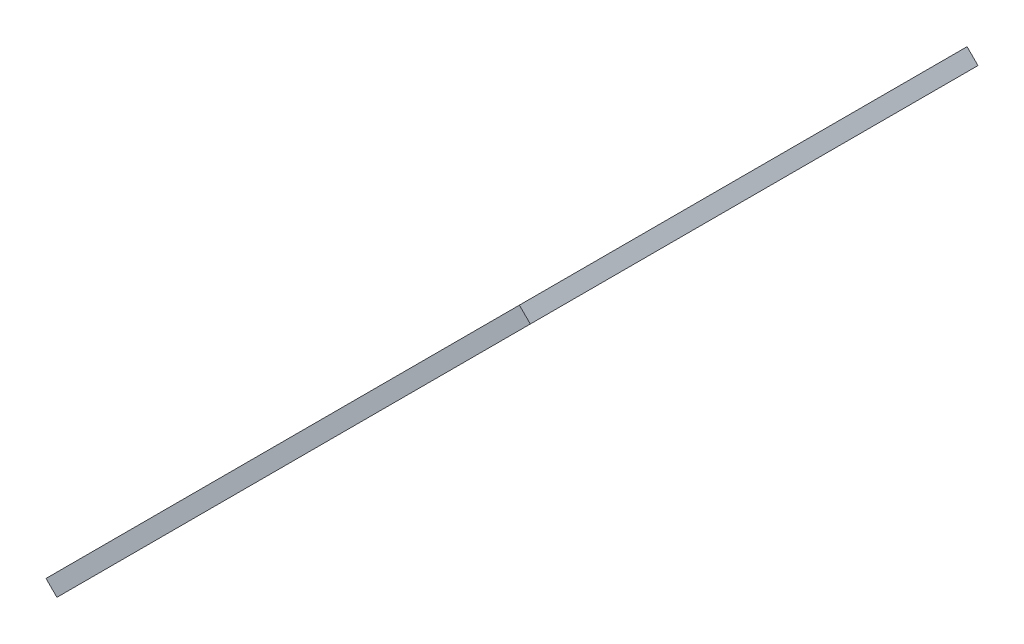
ISO-10303-21;
HEADER;
FILE_DESCRIPTION(('STEP AP214'),'2;1');
FILE_NAME('part.step','',(''),(''),'','','');
FILE_SCHEMA(('AUTOMOTIVE_DESIGN { 1 0 10303 214 1 1 1 1 }'));
ENDSEC;
DATA;
#1=APPLICATION_CONTEXT('core data for automotive mechanical design processes');
#2=APPLICATION_PROTOCOL_DEFINITION('international standard','automotive_design',2000,#1);
#3=PRODUCT_CONTEXT('',#1,'mechanical');
#4=PRODUCT('Part','Part','',(#3));
#5=PRODUCT_RELATED_PRODUCT_CATEGORY('part','',(#4));
#6=PRODUCT_DEFINITION_FORMATION('','',#4);
#7=PRODUCT_DEFINITION_CONTEXT('part definition',#1,'design');
#8=PRODUCT_DEFINITION('design','',#6,#7);
#9=PRODUCT_DEFINITION_SHAPE('','',#8);
#10=(LENGTH_UNIT() NAMED_UNIT(*) SI_UNIT(.MILLI.,.METRE.));
#11=(NAMED_UNIT(*) PLANE_ANGLE_UNIT() SI_UNIT($,.RADIAN.));
#12=(NAMED_UNIT(*) SI_UNIT($,.STERADIAN.) SOLID_ANGLE_UNIT());
#13=UNCERTAINTY_MEASURE_WITH_UNIT(LENGTH_MEASURE(1.E-05),#10,'distance_accuracy_value','');
#14=(GEOMETRIC_REPRESENTATION_CONTEXT(3) GLOBAL_UNCERTAINTY_ASSIGNED_CONTEXT((#13)) GLOBAL_UNIT_ASSIGNED_CONTEXT((#10,
#11,#12)) REPRESENTATION_CONTEXT('',''));
#15=CARTESIAN_POINT('',(0.,0.,0.));
#16=DIRECTION('',(0.,0.,1.));
#17=DIRECTION('',(1.,0.,0.));
#18=AXIS2_PLACEMENT_3D('',#15,#16,#17);
#19=CARTESIAN_POINT('',(-211.000000000001,83.3431457505084,0.));
#20=DIRECTION('',(-0.707106781186547,-0.707106781186548,0.));
#21=DIRECTION('',(0.,0.,-1.));
#22=AXIS2_PLACEMENT_3D('',#19,#20,#21);
#23=PLANE('',#22);
#24=DIRECTION('',(0.707106781186548,-0.707106781186547,0.));
#25=VECTOR('',#24,1.);
#26=CARTESIAN_POINT('',(-211.000000000001,83.3431457505084,116.));
#27=LINE('',#26,#25);
#28=CARTESIAN_POINT('',(-213.828427124747,86.1715728752546,116.));
#29=VERTEX_POINT('',#28);
#30=CARTESIAN_POINT('',(-211.000000000001,83.3431457505084,116.));
#31=VERTEX_POINT('',#30);
#32=EDGE_CURVE('E11',#29,#31,#27,.T.);
#33=ORIENTED_EDGE('',*,*,#32,.F.);
#34=DIRECTION('',(0.,0.,-1.));
#35=VECTOR('',#34,1.);
#36=CARTESIAN_POINT('',(-213.828427124747,86.1715728752546,0.));
#37=LINE('',#36,#35);
#38=CARTESIAN_POINT('',(-213.828427124747,86.1715728752547,0.));
#39=VERTEX_POINT('',#38);
#40=EDGE_CURVE('E134',#29,#39,#37,.T.);
#41=ORIENTED_EDGE('',*,*,#40,.T.);
#42=DIRECTION('',(0.707106781186548,-0.707106781186547,0.));
#43=VECTOR('',#42,1.);
#44=CARTESIAN_POINT('',(-211.000000000001,83.3431457505084,0.));
#45=LINE('',#44,#43);
#46=CARTESIAN_POINT('',(-211.000000000001,83.3431457505084,0.));
#47=VERTEX_POINT('',#46);
#48=EDGE_CURVE('E53',#39,#47,#45,.T.);
#49=ORIENTED_EDGE('',*,*,#48,.T.);
#50=DIRECTION('',(0.,0.,-1.));
#51=VECTOR('',#50,1.);
#52=CARTESIAN_POINT('',(-211.000000000001,83.3431457505084,0.));
#53=LINE('',#52,#51);
#54=EDGE_CURVE('E242',#31,#47,#53,.T.);
#55=ORIENTED_EDGE('',*,*,#54,.F.);
#56=EDGE_LOOP('',(#33,#41,#49,#55));
#57=FACE_BOUND('',#56,.T.);
#58=ADVANCED_FACE('F43',(#57),#23,.T.);
#59=CARTESIAN_POINT('',(-201.984192431566,92.3589533189436,0.));
#60=DIRECTION('',(0.,0.,-1.));
#61=DIRECTION('',(0.707106781186547,0.707106781186549,0.));
#62=AXIS2_PLACEMENT_3D('',#59,#60,#61);
#63=PLANE('',#62);
#64=ORIENTED_EDGE('',*,*,#48,.F.);
#65=DIRECTION('',(-0.707106781186547,-0.707106781186548,0.));
#66=VECTOR('',#65,1.);
#67=CARTESIAN_POINT('',(-150.000000000001,150.000000000001,0.));
#68=LINE('',#67,#66);
#69=CARTESIAN_POINT('',(-204.812619556312,95.1873804436898,0.));
#70=VERTEX_POINT('',#69);
#71=EDGE_CURVE('E196',#39,#70,#68,.F.);
#72=ORIENTED_EDGE('',*,*,#71,.T.);
#73=DIRECTION('',(0.707106781186548,-0.707106781186547,0.));
#74=VECTOR('',#73,1.);
#75=CARTESIAN_POINT('',(-201.984192431566,92.3589533189436,0.));
#76=LINE('',#75,#74);
#77=CARTESIAN_POINT('',(-201.984192431566,92.3589533189436,0.));
#78=VERTEX_POINT('',#77);
#79=EDGE_CURVE('E235',#70,#78,#76,.T.);
#80=ORIENTED_EDGE('',*,*,#79,.T.);
#81=DIRECTION('',(0.707106781186547,0.707106781186549,0.));
#82=VECTOR('',#81,1.);
#83=CARTESIAN_POINT('',(-201.984192431566,92.3589533189436,0.));
#84=LINE('',#83,#82);
#85=EDGE_CURVE('E251',#47,#78,#84,.T.);
#86=ORIENTED_EDGE('',*,*,#85,.F.);
#87=EDGE_LOOP('',(#64,#72,#80,#86));
#88=FACE_BOUND('',#87,.T.);
#89=ADVANCED_FACE('F255',(#88),#63,.T.);
#90=CARTESIAN_POINT('',(-201.984192431566,92.3589533189436,-3.00000000000003));
#91=DIRECTION('',(-0.707106781186547,-0.707106781186548,0.));
#92=DIRECTION('',(0.,0.,-1.));
#93=AXIS2_PLACEMENT_3D('',#90,#91,#92);
#94=PLANE('',#93);
#95=ORIENTED_EDGE('',*,*,#79,.F.);
#96=DIRECTION('',(0.,0.,-1.));
#97=VECTOR('',#96,1.);
#98=CARTESIAN_POINT('',(-204.812619556312,95.1873804436898,0.));
#99=LINE('',#98,#97);
#100=CARTESIAN_POINT('',(-204.812619556312,95.1873804436898,-3.00000000000003));
#101=VERTEX_POINT('',#100);
#102=EDGE_CURVE('E192',#70,#101,#99,.T.);
#103=ORIENTED_EDGE('',*,*,#102,.T.);
#104=DIRECTION('',(0.707106781186548,-0.707106781186547,0.));
#105=VECTOR('',#104,1.);
#106=CARTESIAN_POINT('',(-201.984192431566,92.3589533189436,-3.00000000000003));
#107=LINE('',#106,#105);
#108=CARTESIAN_POINT('',(-201.984192431566,92.3589533189436,-3.00000000000003));
#109=VERTEX_POINT('',#108);
#110=EDGE_CURVE('E232',#101,#109,#107,.T.);
#111=ORIENTED_EDGE('',*,*,#110,.T.);
#112=DIRECTION('',(0.,0.,-1.));
#113=VECTOR('',#112,1.);
#114=CARTESIAN_POINT('',(-201.984192431566,92.3589533189436,-3.00000000000003));
#115=LINE('',#114,#113);
#116=EDGE_CURVE('E257',#78,#109,#115,.T.);
#117=ORIENTED_EDGE('',*,*,#116,.F.);
#118=EDGE_LOOP('',(#95,#103,#111,#117));
#119=FACE_BOUND('',#118,.T.);
#120=ADVANCED_FACE('F332',(#119),#94,.T.);
#121=CARTESIAN_POINT('',(-195.620231400887,98.7229143496225,-3.00000000000003));
#122=DIRECTION('',(0.,0.,-1.));
#123=DIRECTION('',(0.707106781186547,0.707106781186547,0.));
#124=AXIS2_PLACEMENT_3D('',#121,#122,#123);
#125=PLANE('',#124);
#126=ORIENTED_EDGE('',*,*,#110,.F.);
#127=DIRECTION('',(-0.707106781186547,-0.707106781186548,0.));
#128=VECTOR('',#127,1.);
#129=CARTESIAN_POINT('',(-150.000000000001,150.000000000001,-3.00000000000003));
#130=LINE('',#129,#128);
#131=CARTESIAN_POINT('',(-198.448658525633,101.551341474369,-3.00000000000003));
#132=VERTEX_POINT('',#131);
#133=EDGE_CURVE('E188',#101,#132,#130,.F.);
#134=ORIENTED_EDGE('',*,*,#133,.T.);
#135=DIRECTION('',(0.707106781186548,-0.707106781186547,0.));
#136=VECTOR('',#135,1.);
#137=CARTESIAN_POINT('',(-195.620231400887,98.7229143496225,-3.00000000000003));
#138=LINE('',#137,#136);
#139=CARTESIAN_POINT('',(-195.620231400887,98.7229143496225,-3.00000000000003));
#140=VERTEX_POINT('',#139);
#141=EDGE_CURVE('E229',#132,#140,#138,.T.);
#142=ORIENTED_EDGE('',*,*,#141,.T.);
#143=DIRECTION('',(0.707106781186547,0.707106781186547,0.));
#144=VECTOR('',#143,1.);
#145=CARTESIAN_POINT('',(-195.620231400887,98.7229143496225,-3.00000000000003));
#146=LINE('',#145,#144);
#147=EDGE_CURVE('E261',#109,#140,#146,.T.);
#148=ORIENTED_EDGE('',*,*,#147,.F.);
#149=EDGE_LOOP('',(#126,#134,#142,#148));
#150=FACE_BOUND('',#149,.T.);
#151=ADVANCED_FACE('F337',(#150),#125,.T.);
#152=CARTESIAN_POINT('',(-195.620231400887,98.7229143496225,0.));
#153=DIRECTION('',(0.707106781186547,0.707106781186548,0.));
#154=DIRECTION('',(0.,0.,1.));
#155=AXIS2_PLACEMENT_3D('',#152,#153,#154);
#156=PLANE('',#155);
#157=ORIENTED_EDGE('',*,*,#141,.F.);
#158=DIRECTION('',(0.,0.,-1.));
#159=VECTOR('',#158,1.);
#160=CARTESIAN_POINT('',(-198.448658525633,101.551341474369,0.));
#161=LINE('',#160,#159);
#162=CARTESIAN_POINT('',(-198.448658525633,101.551341474369,0.));
#163=VERTEX_POINT('',#162);
#164=EDGE_CURVE('E184',#132,#163,#161,.F.);
#165=ORIENTED_EDGE('',*,*,#164,.T.);
#166=DIRECTION('',(0.707106781186548,-0.707106781186547,0.));
#167=VECTOR('',#166,1.);
#168=CARTESIAN_POINT('',(-195.620231400887,98.7229143496225,0.));
#169=LINE('',#168,#167);
#170=CARTESIAN_POINT('',(-195.620231400887,98.7229143496225,0.));
#171=VERTEX_POINT('',#170);
#172=EDGE_CURVE('E226',#163,#171,#169,.T.);
#173=ORIENTED_EDGE('',*,*,#172,.T.);
#174=DIRECTION('',(0.,0.,1.));
#175=VECTOR('',#174,1.);
#176=CARTESIAN_POINT('',(-195.620231400887,98.7229143496225,0.));
#177=LINE('',#176,#175);
#178=EDGE_CURVE('E268',#140,#171,#177,.T.);
#179=ORIENTED_EDGE('',*,*,#178,.F.);
#180=EDGE_LOOP('',(#157,#165,#173,#179));
#181=FACE_BOUND('',#180,.T.);
#182=ADVANCED_FACE('F341',(#181),#156,.T.);
#183=CARTESIAN_POINT('',(-161.3398657465,133.00328000401,0.));
#184=DIRECTION('',(0.,0.,-1.));
#185=DIRECTION('',(0.707106781186546,0.707106781186549,0.));
#186=AXIS2_PLACEMENT_3D('',#183,#184,#185);
#187=PLANE('',#186);
#188=ORIENTED_EDGE('',*,*,#172,.F.);
#189=DIRECTION('',(-0.707106781186547,-0.707106781186548,0.));
#190=VECTOR('',#189,1.);
#191=CARTESIAN_POINT('',(-150.000000000001,150.000000000001,0.));
#192=LINE('',#191,#190);
#193=CARTESIAN_POINT('',(-164.168292871246,135.831707128756,0.));
#194=VERTEX_POINT('',#193);
#195=EDGE_CURVE('E180',#163,#194,#192,.F.);
#196=ORIENTED_EDGE('',*,*,#195,.T.);
#197=DIRECTION('',(0.707106781186548,-0.707106781186547,0.));
#198=VECTOR('',#197,1.);
#199=CARTESIAN_POINT('',(-161.3398657465,133.00328000401,0.));
#200=LINE('',#199,#198);
#201=CARTESIAN_POINT('',(-161.3398657465,133.00328000401,0.));
#202=VERTEX_POINT('',#201);
#203=EDGE_CURVE('E223',#194,#202,#200,.T.);
#204=ORIENTED_EDGE('',*,*,#203,.T.);
#205=DIRECTION('',(0.707106781186546,0.707106781186549,0.));
#206=VECTOR('',#205,1.);
#207=CARTESIAN_POINT('',(-161.3398657465,133.00328000401,0.));
#208=LINE('',#207,#206);
#209=EDGE_CURVE('E272',#171,#202,#208,.T.);
#210=ORIENTED_EDGE('',*,*,#209,.F.);
#211=EDGE_LOOP('',(#188,#196,#204,#210));
#212=FACE_BOUND('',#211,.T.);
#213=ADVANCED_FACE('F345',(#212),#187,.T.);
#214=CARTESIAN_POINT('',(-161.3398657465,133.00328000401,-3.00000000000002));
#215=DIRECTION('',(-0.707106781186547,-0.707106781186548,0.));
#216=DIRECTION('',(0.,0.,-1.));
#217=AXIS2_PLACEMENT_3D('',#214,#215,#216);
#218=PLANE('',#217);
#219=ORIENTED_EDGE('',*,*,#203,.F.);
#220=DIRECTION('',(0.,0.,-1.));
#221=VECTOR('',#220,1.);
#222=CARTESIAN_POINT('',(-164.168292871246,135.831707128756,0.));
#223=LINE('',#222,#221);
#224=CARTESIAN_POINT('',(-164.168292871246,135.831707128756,-3.00000000000002));
#225=VERTEX_POINT('',#224);
#226=EDGE_CURVE('E176',#194,#225,#223,.T.);
#227=ORIENTED_EDGE('',*,*,#226,.T.);
#228=DIRECTION('',(0.707106781186548,-0.707106781186547,0.));
#229=VECTOR('',#228,1.);
#230=CARTESIAN_POINT('',(-161.3398657465,133.00328000401,-3.00000000000002));
#231=LINE('',#230,#229);
#232=CARTESIAN_POINT('',(-161.3398657465,133.00328000401,-3.00000000000002));
#233=VERTEX_POINT('',#232);
#234=EDGE_CURVE('E220',#225,#233,#231,.T.);
#235=ORIENTED_EDGE('',*,*,#234,.T.);
#236=DIRECTION('',(0.,0.,-1.));
#237=VECTOR('',#236,1.);
#238=CARTESIAN_POINT('',(-161.3398657465,133.00328000401,-3.00000000000002));
#239=LINE('',#238,#237);
#240=EDGE_CURVE('E276',#202,#233,#239,.T.);
#241=ORIENTED_EDGE('',*,*,#240,.F.);
#242=EDGE_LOOP('',(#219,#227,#235,#241));
#243=FACE_BOUND('',#242,.T.);
#244=ADVANCED_FACE('F349',(#243),#218,.T.);
#245=CARTESIAN_POINT('',(-154.975904715821,139.367241034689,-3.00000000000002));
#246=DIRECTION('',(0.,0.,-1.));
#247=DIRECTION('',(0.707106781186547,0.707106781186547,0.));
#248=AXIS2_PLACEMENT_3D('',#245,#246,#247);
#249=PLANE('',#248);
#250=ORIENTED_EDGE('',*,*,#234,.F.);
#251=DIRECTION('',(-0.707106781186547,-0.707106781186548,0.));
#252=VECTOR('',#251,1.);
#253=CARTESIAN_POINT('',(-150.000000000001,150.000000000001,-3.00000000000002));
#254=LINE('',#253,#252);
#255=CARTESIAN_POINT('',(-157.804331840567,142.195668159435,-3.00000000000002));
#256=VERTEX_POINT('',#255);
#257=EDGE_CURVE('E172',#225,#256,#254,.F.);
#258=ORIENTED_EDGE('',*,*,#257,.T.);
#259=DIRECTION('',(0.707106781186548,-0.707106781186547,0.));
#260=VECTOR('',#259,1.);
#261=CARTESIAN_POINT('',(-154.975904715821,139.367241034689,-3.00000000000002));
#262=LINE('',#261,#260);
#263=CARTESIAN_POINT('',(-154.975904715821,139.367241034689,-3.00000000000002));
#264=VERTEX_POINT('',#263);
#265=EDGE_CURVE('E217',#256,#264,#262,.T.);
#266=ORIENTED_EDGE('',*,*,#265,.T.);
#267=DIRECTION('',(0.707106781186547,0.707106781186547,0.));
#268=VECTOR('',#267,1.);
#269=CARTESIAN_POINT('',(-154.975904715821,139.367241034689,-3.00000000000002));
#270=LINE('',#269,#268);
#271=EDGE_CURVE('E280',#233,#264,#270,.T.);
#272=ORIENTED_EDGE('',*,*,#271,.F.);
#273=EDGE_LOOP('',(#250,#258,#266,#272));
#274=FACE_BOUND('',#273,.T.);
#275=ADVANCED_FACE('F353',(#274),#249,.T.);
#276=CARTESIAN_POINT('',(-154.975904715821,139.367241034689,0.));
#277=DIRECTION('',(0.707106781186547,0.707106781186548,0.));
#278=DIRECTION('',(0.,0.,1.));
#279=AXIS2_PLACEMENT_3D('',#276,#277,#278);
#280=PLANE('',#279);
#281=ORIENTED_EDGE('',*,*,#265,.F.);
#282=DIRECTION('',(0.,0.,-1.));
#283=VECTOR('',#282,1.);
#284=CARTESIAN_POINT('',(-157.804331840567,142.195668159435,0.));
#285=LINE('',#284,#283);
#286=CARTESIAN_POINT('',(-157.804331840567,142.195668159435,0.));
#287=VERTEX_POINT('',#286);
#288=EDGE_CURVE('E168',#256,#287,#285,.F.);
#289=ORIENTED_EDGE('',*,*,#288,.T.);
#290=DIRECTION('',(0.707106781186548,-0.707106781186547,0.));
#291=VECTOR('',#290,1.);
#292=CARTESIAN_POINT('',(-154.975904715821,139.367241034689,0.));
#293=LINE('',#292,#291);
#294=CARTESIAN_POINT('',(-154.975904715821,139.367241034689,0.));
#295=VERTEX_POINT('',#294);
#296=EDGE_CURVE('E214',#287,#295,#293,.T.);
#297=ORIENTED_EDGE('',*,*,#296,.T.);
#298=DIRECTION('',(0.,0.,1.));
#299=VECTOR('',#298,1.);
#300=CARTESIAN_POINT('',(-154.975904715821,139.367241034689,0.));
#301=LINE('',#300,#299);
#302=EDGE_CURVE('E284',#264,#295,#301,.T.);
#303=ORIENTED_EDGE('',*,*,#302,.F.);
#304=EDGE_LOOP('',(#281,#289,#297,#303));
#305=FACE_BOUND('',#304,.T.);
#306=ADVANCED_FACE('F357',(#305),#280,.T.);
#307=CARTESIAN_POINT('',(-120.695539061433,173.647606689076,0.));
#308=DIRECTION('',(0.,0.,-1.));
#309=DIRECTION('',(0.707106781186546,0.707106781186549,0.));
#310=AXIS2_PLACEMENT_3D('',#307,#308,#309);
#311=PLANE('',#310);
#312=ORIENTED_EDGE('',*,*,#296,.F.);
#313=DIRECTION('',(-0.707106781186547,-0.707106781186548,0.));
#314=VECTOR('',#313,1.);
#315=CARTESIAN_POINT('',(-150.000000000001,150.000000000001,0.));
#316=LINE('',#315,#314);
#317=CARTESIAN_POINT('',(-123.52396618618,176.476033813823,0.));
#318=VERTEX_POINT('',#317);
#319=EDGE_CURVE('E164',#287,#318,#316,.F.);
#320=ORIENTED_EDGE('',*,*,#319,.T.);
#321=DIRECTION('',(0.707106781186548,-0.707106781186547,0.));
#322=VECTOR('',#321,1.);
#323=CARTESIAN_POINT('',(-120.695539061433,173.647606689076,0.));
#324=LINE('',#323,#322);
#325=CARTESIAN_POINT('',(-120.695539061433,173.647606689076,0.));
#326=VERTEX_POINT('',#325);
#327=EDGE_CURVE('E211',#318,#326,#324,.T.);
#328=ORIENTED_EDGE('',*,*,#327,.T.);
#329=DIRECTION('',(0.707106781186546,0.707106781186549,0.));
#330=VECTOR('',#329,1.);
#331=CARTESIAN_POINT('',(-120.695539061433,173.647606689076,0.));
#332=LINE('',#331,#330);
#333=EDGE_CURVE('E288',#295,#326,#332,.T.);
#334=ORIENTED_EDGE('',*,*,#333,.F.);
#335=EDGE_LOOP('',(#312,#320,#328,#334));
#336=FACE_BOUND('',#335,.T.);
#337=ADVANCED_FACE('F361',(#336),#311,.T.);
#338=CARTESIAN_POINT('',(-120.695539061433,173.647606689076,-3.00000000000002));
#339=DIRECTION('',(-0.707106781186547,-0.707106781186548,0.));
#340=DIRECTION('',(0.,0.,-1.));
#341=AXIS2_PLACEMENT_3D('',#338,#339,#340);
#342=PLANE('',#341);
#343=ORIENTED_EDGE('',*,*,#327,.F.);
#344=DIRECTION('',(0.,0.,-1.));
#345=VECTOR('',#344,1.);
#346=CARTESIAN_POINT('',(-123.52396618618,176.476033813823,0.));
#347=LINE('',#346,#345);
#348=CARTESIAN_POINT('',(-123.52396618618,176.476033813823,-3.00000000000002));
#349=VERTEX_POINT('',#348);
#350=EDGE_CURVE('E160',#318,#349,#347,.T.);
#351=ORIENTED_EDGE('',*,*,#350,.T.);
#352=DIRECTION('',(0.707106781186548,-0.707106781186547,0.));
#353=VECTOR('',#352,1.);
#354=CARTESIAN_POINT('',(-120.695539061433,173.647606689076,-3.00000000000002));
#355=LINE('',#354,#353);
#356=CARTESIAN_POINT('',(-120.695539061433,173.647606689076,-3.00000000000002));
#357=VERTEX_POINT('',#356);
#358=EDGE_CURVE('E208',#349,#357,#355,.T.);
#359=ORIENTED_EDGE('',*,*,#358,.T.);
#360=DIRECTION('',(0.,0.,-1.));
#361=VECTOR('',#360,1.);
#362=CARTESIAN_POINT('',(-120.695539061433,173.647606689076,-3.00000000000002));
#363=LINE('',#362,#361);
#364=EDGE_CURVE('E292',#326,#357,#363,.T.);
#365=ORIENTED_EDGE('',*,*,#364,.F.);
#366=EDGE_LOOP('',(#343,#351,#359,#365));
#367=FACE_BOUND('',#366,.T.);
#368=ADVANCED_FACE('F365',(#367),#342,.T.);
#369=CARTESIAN_POINT('',(-114.331578030755,180.011567719755,-3.));
#370=DIRECTION('',(0.,0.,-1.));
#371=DIRECTION('',(0.707106781186547,0.707106781186547,0.));
#372=AXIS2_PLACEMENT_3D('',#369,#370,#371);
#373=PLANE('',#372);
#374=ORIENTED_EDGE('',*,*,#358,.F.);
#375=DIRECTION('',(-0.707106781186547,-0.707106781186548,0.));
#376=VECTOR('',#375,1.);
#377=CARTESIAN_POINT('',(-150.000000000001,150.000000000001,-3.00000000000002));
#378=LINE('',#377,#376);
#379=CARTESIAN_POINT('',(-117.160005155501,182.839994844501,-3.));
#380=VERTEX_POINT('',#379);
#381=EDGE_CURVE('E156',#349,#380,#378,.F.);
#382=ORIENTED_EDGE('',*,*,#381,.T.);
#383=DIRECTION('',(0.707106781186548,-0.707106781186547,0.));
#384=VECTOR('',#383,1.);
#385=CARTESIAN_POINT('',(-114.331578030755,180.011567719755,-3.));
#386=LINE('',#385,#384);
#387=CARTESIAN_POINT('',(-114.331578030755,180.011567719755,-3.));
#388=VERTEX_POINT('',#387);
#389=EDGE_CURVE('E205',#380,#388,#386,.T.);
#390=ORIENTED_EDGE('',*,*,#389,.T.);
#391=DIRECTION('',(0.707106781186547,0.707106781186547,0.));
#392=VECTOR('',#391,1.);
#393=CARTESIAN_POINT('',(-114.331578030755,180.011567719755,-3.));
#394=LINE('',#393,#392);
#395=EDGE_CURVE('E296',#357,#388,#394,.T.);
#396=ORIENTED_EDGE('',*,*,#395,.F.);
#397=EDGE_LOOP('',(#374,#382,#390,#396));
#398=FACE_BOUND('',#397,.T.);
#399=ADVANCED_FACE('F369',(#398),#373,.T.);
#400=CARTESIAN_POINT('',(-114.331578030755,180.011567719755,0.));
#401=DIRECTION('',(0.707106781186547,0.707106781186548,0.));
#402=DIRECTION('',(0.,0.,1.));
#403=AXIS2_PLACEMENT_3D('',#400,#401,#402);
#404=PLANE('',#403);
#405=ORIENTED_EDGE('',*,*,#389,.F.);
#406=DIRECTION('',(0.,0.,-1.));
#407=VECTOR('',#406,1.);
#408=CARTESIAN_POINT('',(-117.160005155501,182.839994844501,0.));
#409=LINE('',#408,#407);
#410=CARTESIAN_POINT('',(-117.160005155501,182.839994844501,0.));
#411=VERTEX_POINT('',#410);
#412=EDGE_CURVE('E152',#380,#411,#409,.F.);
#413=ORIENTED_EDGE('',*,*,#412,.T.);
#414=DIRECTION('',(0.707106781186548,-0.707106781186547,0.));
#415=VECTOR('',#414,1.);
#416=CARTESIAN_POINT('',(-114.331578030755,180.011567719755,0.));
#417=LINE('',#416,#415);
#418=CARTESIAN_POINT('',(-114.331578030755,180.011567719755,0.));
#419=VERTEX_POINT('',#418);
#420=EDGE_CURVE('E203',#411,#419,#417,.T.);
#421=ORIENTED_EDGE('',*,*,#420,.T.);
#422=DIRECTION('',(0.,0.,1.));
#423=VECTOR('',#422,1.);
#424=CARTESIAN_POINT('',(-114.331578030755,180.011567719755,0.));
#425=LINE('',#424,#423);
#426=EDGE_CURVE('E300',#388,#419,#425,.T.);
#427=ORIENTED_EDGE('',*,*,#426,.F.);
#428=EDGE_LOOP('',(#405,#413,#421,#427));
#429=FACE_BOUND('',#428,.T.);
#430=ADVANCED_FACE('F373',(#429),#404,.T.);
#431=CARTESIAN_POINT('',(-88.3431457505086,206.000000000001,0.));
#432=DIRECTION('',(0.,0.,-1.));
#433=DIRECTION('',(0.707106781186547,0.707106781186548,0.));
#434=AXIS2_PLACEMENT_3D('',#431,#432,#433);
#435=PLANE('',#434);
#436=ORIENTED_EDGE('',*,*,#420,.F.);
#437=DIRECTION('',(-0.707106781186547,-0.707106781186548,0.));
#438=VECTOR('',#437,1.);
#439=CARTESIAN_POINT('',(-150.000000000001,150.000000000001,0.));
#440=LINE('',#439,#438);
#441=CARTESIAN_POINT('',(-91.1715728752548,208.828427124747,0.));
#442=VERTEX_POINT('',#441);
#443=EDGE_CURVE('E148',#411,#442,#440,.F.);
#444=ORIENTED_EDGE('',*,*,#443,.T.);
#445=DIRECTION('',(0.707106781186548,-0.707106781186547,0.));
#446=VECTOR('',#445,1.);
#447=CARTESIAN_POINT('',(-88.3431457505086,206.000000000001,0.));
#448=LINE('',#447,#446);
#449=CARTESIAN_POINT('',(-88.3431457505086,206.000000000001,0.));
#450=VERTEX_POINT('',#449);
#451=EDGE_CURVE('E61',#442,#450,#448,.T.);
#452=ORIENTED_EDGE('',*,*,#451,.T.);
#453=DIRECTION('',(0.707106781186547,0.707106781186548,0.));
#454=VECTOR('',#453,1.);
#455=CARTESIAN_POINT('',(-88.3431457505086,206.000000000001,0.));
#456=LINE('',#455,#454);
#457=EDGE_CURVE('E127',#419,#450,#456,.T.);
#458=ORIENTED_EDGE('',*,*,#457,.F.);
#459=EDGE_LOOP('',(#436,#444,#452,#458));
#460=FACE_BOUND('',#459,.T.);
#461=ADVANCED_FACE('F324',(#460),#435,.T.);
#462=CARTESIAN_POINT('',(-88.3431457505086,206.000000000001,116.));
#463=DIRECTION('',(0.707106781186547,0.707106781186548,0.));
#464=DIRECTION('',(0.,0.,1.));
#465=AXIS2_PLACEMENT_3D('',#462,#463,#464);
#466=PLANE('',#465);
#467=ORIENTED_EDGE('',*,*,#451,.F.);
#468=DIRECTION('',(0.,0.,-1.));
#469=VECTOR('',#468,1.);
#470=CARTESIAN_POINT('',(-91.1715728752548,208.828427124747,0.));
#471=LINE('',#470,#469);
#472=CARTESIAN_POINT('',(-91.1715728752548,208.828427124747,116.));
#473=VERTEX_POINT('',#472);
#474=EDGE_CURVE('E132',#442,#473,#471,.F.);
#475=ORIENTED_EDGE('',*,*,#474,.T.);
#476=DIRECTION('',(0.707106781186548,-0.707106781186547,0.));
#477=VECTOR('',#476,1.);
#478=CARTESIAN_POINT('',(-88.3431457505086,206.000000000001,116.));
#479=LINE('',#478,#477);
#480=CARTESIAN_POINT('',(-88.3431457505086,206.000000000001,116.));
#481=VERTEX_POINT('',#480);
#482=EDGE_CURVE('E47',#473,#481,#479,.T.);
#483=ORIENTED_EDGE('',*,*,#482,.T.);
#484=DIRECTION('',(0.,0.,1.));
#485=VECTOR('',#484,1.);
#486=CARTESIAN_POINT('',(-88.3431457505086,206.000000000001,116.));
#487=LINE('',#486,#485);
#488=EDGE_CURVE('E423',#450,#481,#487,.T.);
#489=ORIENTED_EDGE('',*,*,#488,.F.);
#490=EDGE_LOOP('',(#467,#475,#483,#489));
#491=FACE_BOUND('',#490,.T.);
#492=ADVANCED_FACE('F137',(#491),#466,.T.);
#493=CARTESIAN_POINT('',(-142.600505063389,151.74264068712,100.));
#494=DIRECTION('',(0.707106781186548,-0.707106781186547,0.));
#495=DIRECTION('',(0.707106781186547,0.707106781186548,0.));
#496=AXIS2_PLACEMENT_3D('',#493,#494,#495);
#497=CYLINDRICAL_SURFACE('',#496,1.64999999999999);
#498=CARTESIAN_POINT('',(-142.600505063389,151.74264068712,100.));
#499=DIRECTION('',(0.707106781186548,-0.707106781186547,0.));
#500=DIRECTION('',(0.707106781186547,0.707106781186548,0.));
#501=AXIS2_PLACEMENT_3D('',#498,#499,#500);
#502=CIRCLE('',#501,1.64999999999999);
#503=CARTESIAN_POINT('',(-141.433778874432,152.909366876078,100.));
#504=VERTEX_POINT('',#503);
#505=EDGE_CURVE('E151',#504,#504,#502,.T.);
#506=ORIENTED_EDGE('',*,*,#505,.T.);
#507=EDGE_LOOP('',(#506));
#508=FACE_BOUND('',#507,.T.);
#509=CARTESIAN_POINT('',(-145.428932188136,154.571067811867,100.));
#510=DIRECTION('',(0.707106781186548,-0.707106781186547,0.));
#511=DIRECTION('',(0.707106781186547,0.707106781186548,0.));
#512=AXIS2_PLACEMENT_3D('',#509,#510,#511);
#513=CIRCLE('',#512,1.64999999999999);
#514=CARTESIAN_POINT('',(-144.262205999178,155.737794000824,100.));
#515=VERTEX_POINT('',#514);
#516=EDGE_CURVE('E144',#515,#515,#513,.T.);
#517=ORIENTED_EDGE('',*,*,#516,.F.);
#518=EDGE_LOOP('',(#517));
#519=FACE_BOUND('',#518,.T.);
#520=ADVANCED_FACE('F313',(#508,#519),#497,.F.);
#521=CARTESIAN_POINT('',(-156.74264068712,137.600505063389,100.));
#522=DIRECTION('',(0.707106781186548,-0.707106781186547,0.));
#523=DIRECTION('',(0.707106781186547,0.707106781186548,0.));
#524=AXIS2_PLACEMENT_3D('',#521,#522,#523);
#525=CYLINDRICAL_SURFACE('',#524,1.64999999999999);
#526=CARTESIAN_POINT('',(-156.74264068712,137.600505063389,100.));
#527=DIRECTION('',(0.707106781186548,-0.707106781186547,0.));
#528=DIRECTION('',(0.707106781186547,0.707106781186548,0.));
#529=AXIS2_PLACEMENT_3D('',#526,#527,#528);
#530=CIRCLE('',#529,1.64999999999999);
#531=CARTESIAN_POINT('',(-155.575914498163,138.767231252347,100.));
#532=VERTEX_POINT('',#531);
#533=EDGE_CURVE('E425',#532,#532,#530,.T.);
#534=ORIENTED_EDGE('',*,*,#533,.T.);
#535=EDGE_LOOP('',(#534));
#536=FACE_BOUND('',#535,.T.);
#537=CARTESIAN_POINT('',(-159.571067811867,140.428932188136,100.));
#538=DIRECTION('',(0.707106781186548,-0.707106781186547,0.));
#539=DIRECTION('',(0.707106781186547,0.707106781186548,0.));
#540=AXIS2_PLACEMENT_3D('',#537,#538,#539);
#541=CIRCLE('',#540,1.64999999999999);
#542=CARTESIAN_POINT('',(-158.404341622909,141.595658377093,100.));
#543=VERTEX_POINT('',#542);
#544=EDGE_CURVE('E139',#543,#543,#541,.T.);
#545=ORIENTED_EDGE('',*,*,#544,.F.);
#546=EDGE_LOOP('',(#545));
#547=FACE_BOUND('',#546,.T.);
#548=ADVANCED_FACE('F315',(#536,#547),#525,.F.);
#549=CARTESIAN_POINT('',(-211.000000000001,83.3431457505084,116.));
#550=DIRECTION('',(0.,0.,1.));
#551=DIRECTION('',(-0.707106781186547,-0.707106781186548,0.));
#552=AXIS2_PLACEMENT_3D('',#549,#550,#551);
#553=PLANE('',#552);
#554=DIRECTION('',(-0.707106781186547,-0.707106781186548,0.));
#555=VECTOR('',#554,1.);
#556=CARTESIAN_POINT('',(-150.000000000001,150.000000000001,116.));
#557=LINE('',#556,#555);
#558=EDGE_CURVE('E121',#473,#29,#557,.T.);
#559=ORIENTED_EDGE('',*,*,#558,.T.);
#560=ORIENTED_EDGE('',*,*,#32,.T.);
#561=DIRECTION('',(-0.707106781186547,-0.707106781186548,0.));
#562=VECTOR('',#561,1.);
#563=CARTESIAN_POINT('',(-211.000000000001,83.3431457505084,116.));
#564=LINE('',#563,#562);
#565=EDGE_CURVE('E123',#481,#31,#564,.T.);
#566=ORIENTED_EDGE('',*,*,#565,.F.);
#567=ORIENTED_EDGE('',*,*,#482,.F.);
#568=EDGE_LOOP('',(#559,#560,#566,#567));
#569=FACE_BOUND('',#568,.T.);
#570=ADVANCED_FACE('F45',(#569),#553,.T.);
#571=CARTESIAN_POINT('',(-147.171572875255,147.171572875255,0.));
#572=DIRECTION('',(0.707106781186548,-0.707106781186547,0.));
#573=DIRECTION('',(-0.707106781186547,-0.707106781186548,0.));
#574=AXIS2_PLACEMENT_3D('',#571,#572,#573);
#575=PLANE('',#574);
#576=ORIENTED_EDGE('',*,*,#505,.F.);
#577=EDGE_LOOP('',(#576));
#578=FACE_BOUND('',#577,.T.);
#579=ORIENTED_EDGE('',*,*,#533,.F.);
#580=EDGE_LOOP('',(#579));
#581=FACE_BOUND('',#580,.T.);
#582=ORIENTED_EDGE('',*,*,#488,.T.);
#583=ORIENTED_EDGE('',*,*,#565,.T.);
#584=ORIENTED_EDGE('',*,*,#54,.T.);
#585=ORIENTED_EDGE('',*,*,#85,.T.);
#586=ORIENTED_EDGE('',*,*,#116,.T.);
#587=ORIENTED_EDGE('',*,*,#147,.T.);
#588=ORIENTED_EDGE('',*,*,#178,.T.);
#589=ORIENTED_EDGE('',*,*,#209,.T.);
#590=ORIENTED_EDGE('',*,*,#240,.T.);
#591=ORIENTED_EDGE('',*,*,#271,.T.);
#592=ORIENTED_EDGE('',*,*,#302,.T.);
#593=ORIENTED_EDGE('',*,*,#333,.T.);
#594=ORIENTED_EDGE('',*,*,#364,.T.);
#595=ORIENTED_EDGE('',*,*,#395,.T.);
#596=ORIENTED_EDGE('',*,*,#426,.T.);
#597=ORIENTED_EDGE('',*,*,#457,.T.);
#598=EDGE_LOOP('',(#582,#583,#584,#585,#586,#587,#588,#589,#590,#591,#592,#593,#594,#595,#596,#597));
#599=FACE_BOUND('',#598,.T.);
#600=ADVANCED_FACE('F249',(#578,#581,#599),#575,.T.);
#601=CARTESIAN_POINT('',(-150.000000000001,150.000000000001,0.));
#602=DIRECTION('',(0.707106781186548,-0.707106781186547,0.));
#603=DIRECTION('',(-0.707106781186547,-0.707106781186548,0.));
#604=AXIS2_PLACEMENT_3D('',#601,#602,#603);
#605=PLANE('',#604);
#606=ORIENTED_EDGE('',*,*,#516,.T.);
#607=EDGE_LOOP('',(#606));
#608=FACE_BOUND('',#607,.T.);
#609=ORIENTED_EDGE('',*,*,#544,.T.);
#610=EDGE_LOOP('',(#609));
#611=FACE_BOUND('',#610,.T.);
#612=ORIENTED_EDGE('',*,*,#474,.F.);
#613=ORIENTED_EDGE('',*,*,#443,.F.);
#614=ORIENTED_EDGE('',*,*,#412,.F.);
#615=ORIENTED_EDGE('',*,*,#381,.F.);
#616=ORIENTED_EDGE('',*,*,#350,.F.);
#617=ORIENTED_EDGE('',*,*,#319,.F.);
#618=ORIENTED_EDGE('',*,*,#288,.F.);
#619=ORIENTED_EDGE('',*,*,#257,.F.);
#620=ORIENTED_EDGE('',*,*,#226,.F.);
#621=ORIENTED_EDGE('',*,*,#195,.F.);
#622=ORIENTED_EDGE('',*,*,#164,.F.);
#623=ORIENTED_EDGE('',*,*,#133,.F.);
#624=ORIENTED_EDGE('',*,*,#102,.F.);
#625=ORIENTED_EDGE('',*,*,#71,.F.);
#626=ORIENTED_EDGE('',*,*,#40,.F.);
#627=ORIENTED_EDGE('',*,*,#558,.F.);
#628=EDGE_LOOP('',(#612,#613,#614,#615,#616,#617,#618,#619,#620,#621,#622,#623,#624,#625,#626,#627));
#629=FACE_BOUND('',#628,.T.);
#630=ADVANCED_FACE('F130',(#608,#611,#629),#605,.F.);
#631=CLOSED_SHELL('',(#58,#89,#120,#151,#182,#213,#244,#275,#306,#337,#368,#399,#430,#461,#492,
#520,#548,#570,#600,#630));
#632=MANIFOLD_SOLID_BREP('B2',#631);
#633=ADVANCED_BREP_SHAPE_REPRESENTATION('',(#18,#632),#14);
#634=SHAPE_DEFINITION_REPRESENTATION(#9,#633);
ENDSEC;
END-ISO-10303-21;
